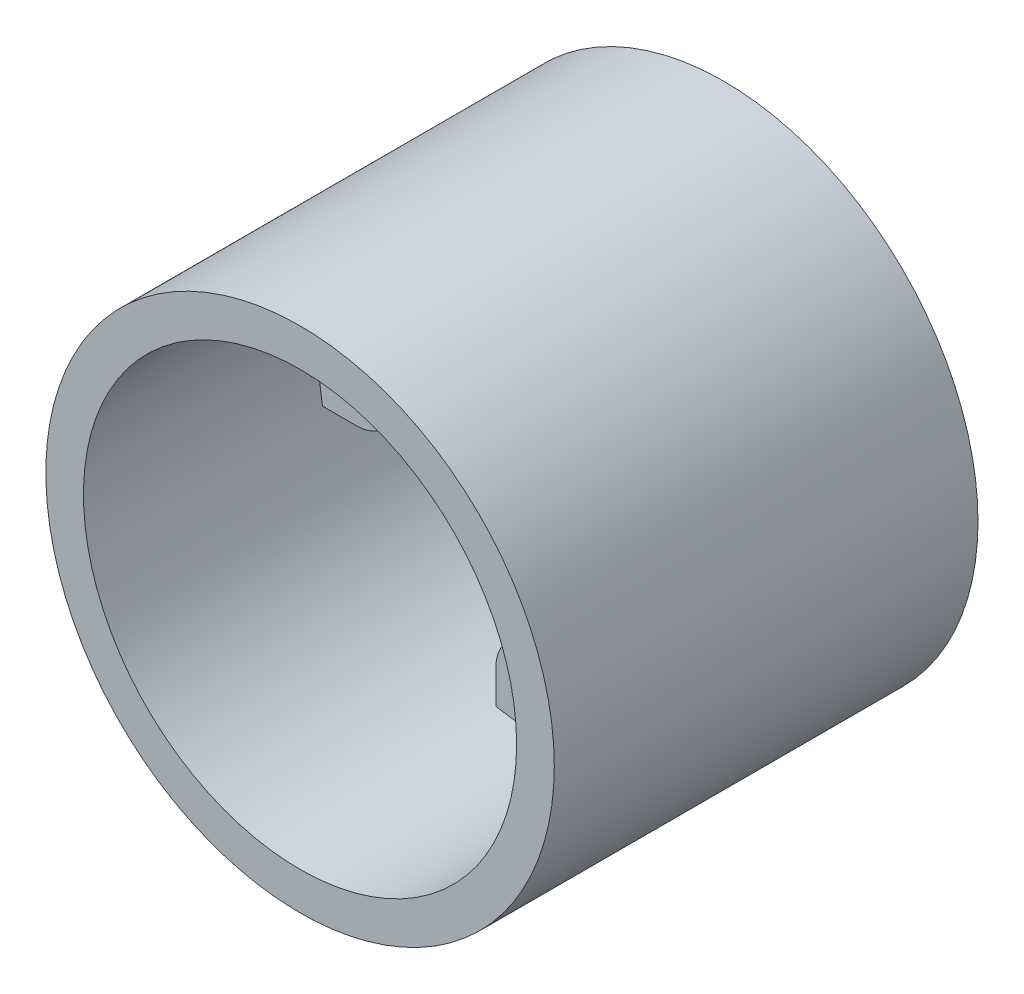
ISO-10303-21;
HEADER;
FILE_DESCRIPTION(('STEP AP214'),'2;1');
FILE_NAME('part.step','',(''),(''),'','','');
FILE_SCHEMA(('AUTOMOTIVE_DESIGN { 1 0 10303 214 1 1 1 1 }'));
ENDSEC;
DATA;
#1=APPLICATION_CONTEXT('core data for automotive mechanical design processes');
#2=APPLICATION_PROTOCOL_DEFINITION('international standard','automotive_design',2000,#1);
#3=PRODUCT_CONTEXT('',#1,'mechanical');
#4=PRODUCT('Part','Part','',(#3));
#5=PRODUCT_RELATED_PRODUCT_CATEGORY('part','',(#4));
#6=PRODUCT_DEFINITION_FORMATION('','',#4);
#7=PRODUCT_DEFINITION_CONTEXT('part definition',#1,'design');
#8=PRODUCT_DEFINITION('design','',#6,#7);
#9=PRODUCT_DEFINITION_SHAPE('','',#8);
#10=(LENGTH_UNIT() NAMED_UNIT(*) SI_UNIT(.MILLI.,.METRE.));
#11=(NAMED_UNIT(*) PLANE_ANGLE_UNIT() SI_UNIT($,.RADIAN.));
#12=(NAMED_UNIT(*) SI_UNIT($,.STERADIAN.) SOLID_ANGLE_UNIT());
#13=UNCERTAINTY_MEASURE_WITH_UNIT(LENGTH_MEASURE(1.E-05),#10,'distance_accuracy_value','');
#14=(GEOMETRIC_REPRESENTATION_CONTEXT(3) GLOBAL_UNCERTAINTY_ASSIGNED_CONTEXT((#13)) GLOBAL_UNIT_ASSIGNED_CONTEXT((#10,
#11,#12)) REPRESENTATION_CONTEXT('',''));
#15=CARTESIAN_POINT('',(0.,0.,0.));
#16=DIRECTION('',(0.,0.,1.));
#17=DIRECTION('',(1.,0.,0.));
#18=AXIS2_PLACEMENT_3D('',#15,#16,#17);
#19=CARTESIAN_POINT('',(0.,0.,45.));
#20=DIRECTION('',(0.,0.,-1.));
#21=DIRECTION('',(-1.,0.,0.));
#22=AXIS2_PLACEMENT_3D('',#19,#20,#21);
#23=CYLINDRICAL_SURFACE('',#22,23.);
#24=DIRECTION('',(0.,0.,-1.));
#25=VECTOR('',#24,1.);
#26=CARTESIAN_POINT('',(22.6132704401641,4.2,20.));
#27=LINE('',#26,#25);
#28=CARTESIAN_POINT('',(22.6132704401641,4.2,20.));
#29=VERTEX_POINT('',#28);
#30=CARTESIAN_POINT('',(22.6132704401641,4.2,0.));
#31=VERTEX_POINT('',#30);
#32=EDGE_CURVE('E206',#29,#31,#27,.T.);
#33=ORIENTED_EDGE('',*,*,#32,.F.);
#34=CARTESIAN_POINT('',(0.,0.,20.));
#35=DIRECTION('',(0.,0.,1.));
#36=DIRECTION('',(1.,0.,0.));
#37=AXIS2_PLACEMENT_3D('',#34,#35,#36);
#38=CIRCLE('',#37,23.);
#39=CARTESIAN_POINT('',(22.6132704401641,-4.2,20.));
#40=VERTEX_POINT('',#39);
#41=EDGE_CURVE('E193',#40,#29,#38,.T.);
#42=ORIENTED_EDGE('',*,*,#41,.F.);
#43=DIRECTION('',(0.,0.,-1.));
#44=VECTOR('',#43,1.);
#45=CARTESIAN_POINT('',(22.6132704401641,-4.2,20.));
#46=LINE('',#45,#44);
#47=CARTESIAN_POINT('',(22.6132704401641,-4.2,0.));
#48=VERTEX_POINT('',#47);
#49=EDGE_CURVE('E221',#40,#48,#46,.T.);
#50=ORIENTED_EDGE('',*,*,#49,.T.);
#51=CARTESIAN_POINT('',(0.,0.,0.));
#52=DIRECTION('',(0.,0.,1.));
#53=DIRECTION('',(1.,0.,0.));
#54=AXIS2_PLACEMENT_3D('',#51,#52,#53);
#55=CIRCLE('',#54,23.);
#56=CARTESIAN_POINT('',(4.2,-22.6132704401641,0.));
#57=VERTEX_POINT('',#56);
#58=EDGE_CURVE('E179',#57,#48,#55,.T.);
#59=ORIENTED_EDGE('',*,*,#58,.F.);
#60=DIRECTION('',(0.,0.,-1.));
#61=VECTOR('',#60,1.);
#62=CARTESIAN_POINT('',(4.2,-22.6132704401641,20.));
#63=LINE('',#62,#61);
#64=CARTESIAN_POINT('',(4.2,-22.6132704401641,20.));
#65=VERTEX_POINT('',#64);
#66=EDGE_CURVE('E246',#65,#57,#63,.T.);
#67=ORIENTED_EDGE('',*,*,#66,.F.);
#68=CARTESIAN_POINT('',(0.,0.,20.));
#69=DIRECTION('',(0.,0.,1.));
#70=DIRECTION('',(1.,0.,0.));
#71=AXIS2_PLACEMENT_3D('',#68,#69,#70);
#72=CIRCLE('',#71,23.);
#73=CARTESIAN_POINT('',(-4.2,-22.6132704401641,20.));
#74=VERTEX_POINT('',#73);
#75=EDGE_CURVE('E243',#74,#65,#72,.T.);
#76=ORIENTED_EDGE('',*,*,#75,.F.);
#77=DIRECTION('',(0.,0.,-1.));
#78=VECTOR('',#77,1.);
#79=CARTESIAN_POINT('',(-4.2,-22.6132704401641,20.));
#80=LINE('',#79,#78);
#81=CARTESIAN_POINT('',(-4.2,-22.6132704401641,0.));
#82=VERTEX_POINT('',#81);
#83=EDGE_CURVE('E262',#74,#82,#80,.T.);
#84=ORIENTED_EDGE('',*,*,#83,.T.);
#85=CARTESIAN_POINT('',(-22.6132704401641,-4.2,0.));
#86=VERTEX_POINT('',#85);
#87=EDGE_CURVE('E374',#86,#82,#55,.T.);
#88=ORIENTED_EDGE('',*,*,#87,.F.);
#89=DIRECTION('',(0.,0.,-1.));
#90=VECTOR('',#89,1.);
#91=CARTESIAN_POINT('',(-22.6132704401641,-4.2,20.));
#92=LINE('',#91,#90);
#93=CARTESIAN_POINT('',(-22.6132704401641,-4.2,20.));
#94=VERTEX_POINT('',#93);
#95=EDGE_CURVE('E291',#94,#86,#92,.T.);
#96=ORIENTED_EDGE('',*,*,#95,.F.);
#97=CARTESIAN_POINT('',(0.,0.,20.));
#98=DIRECTION('',(0.,0.,1.));
#99=DIRECTION('',(1.,0.,0.));
#100=AXIS2_PLACEMENT_3D('',#97,#98,#99);
#101=CIRCLE('',#100,23.);
#102=CARTESIAN_POINT('',(-22.6132704401641,4.2,20.));
#103=VERTEX_POINT('',#102);
#104=EDGE_CURVE('E288',#103,#94,#101,.T.);
#105=ORIENTED_EDGE('',*,*,#104,.F.);
#106=DIRECTION('',(0.,0.,-1.));
#107=VECTOR('',#106,1.);
#108=CARTESIAN_POINT('',(-22.6132704401641,4.2,20.));
#109=LINE('',#108,#107);
#110=CARTESIAN_POINT('',(-22.6132704401641,4.2,0.));
#111=VERTEX_POINT('',#110);
#112=EDGE_CURVE('E307',#103,#111,#109,.T.);
#113=ORIENTED_EDGE('',*,*,#112,.T.);
#114=CARTESIAN_POINT('',(-4.2,22.6132704401641,0.));
#115=VERTEX_POINT('',#114);
#116=EDGE_CURVE('E368',#115,#111,#55,.T.);
#117=ORIENTED_EDGE('',*,*,#116,.F.);
#118=DIRECTION('',(0.,0.,-1.));
#119=VECTOR('',#118,1.);
#120=CARTESIAN_POINT('',(-4.2,22.6132704401641,20.));
#121=LINE('',#120,#119);
#122=CARTESIAN_POINT('',(-4.2,22.6132704401641,20.));
#123=VERTEX_POINT('',#122);
#124=EDGE_CURVE('E336',#123,#115,#121,.T.);
#125=ORIENTED_EDGE('',*,*,#124,.F.);
#126=CARTESIAN_POINT('',(0.,0.,20.));
#127=DIRECTION('',(0.,0.,1.));
#128=DIRECTION('',(1.,0.,0.));
#129=AXIS2_PLACEMENT_3D('',#126,#127,#128);
#130=CIRCLE('',#129,23.);
#131=CARTESIAN_POINT('',(4.2,22.6132704401641,20.));
#132=VERTEX_POINT('',#131);
#133=EDGE_CURVE('E333',#132,#123,#130,.T.);
#134=ORIENTED_EDGE('',*,*,#133,.F.);
#135=DIRECTION('',(0.,0.,-1.));
#136=VECTOR('',#135,1.);
#137=CARTESIAN_POINT('',(4.2,22.6132704401641,20.));
#138=LINE('',#137,#136);
#139=CARTESIAN_POINT('',(4.2,22.6132704401641,0.));
#140=VERTEX_POINT('',#139);
#141=EDGE_CURVE('E353',#132,#140,#138,.T.);
#142=ORIENTED_EDGE('',*,*,#141,.T.);
#143=EDGE_CURVE('E365',#31,#140,#55,.T.);
#144=ORIENTED_EDGE('',*,*,#143,.F.);
#145=EDGE_LOOP('',(#33,#42,#50,#59,#67,#76,#84,#88,#96,#105,#113,#117,#125,#134,#142,#144));
#146=FACE_BOUND('',#145,.T.);
#147=CARTESIAN_POINT('',(0.,0.,45.));
#148=DIRECTION('',(0.,0.,1.));
#149=DIRECTION('',(1.,0.,0.));
#150=AXIS2_PLACEMENT_3D('',#147,#148,#149);
#151=CIRCLE('',#150,23.);
#152=CARTESIAN_POINT('',(23.,0.,45.));
#153=VERTEX_POINT('',#152);
#154=EDGE_CURVE('E58',#153,#153,#151,.T.);
#155=ORIENTED_EDGE('',*,*,#154,.T.);
#156=EDGE_LOOP('',(#155));
#157=FACE_BOUND('',#156,.T.);
#158=ADVANCED_FACE('F49',(#146,#157),#23,.F.);
#159=CARTESIAN_POINT('',(0.,0.,45.));
#160=DIRECTION('',(0.,0.,-1.));
#161=DIRECTION('',(-1.,0.,0.));
#162=AXIS2_PLACEMENT_3D('',#159,#160,#161);
#163=CYLINDRICAL_SURFACE('',#162,27.);
#164=CARTESIAN_POINT('',(0.,0.,45.));
#165=DIRECTION('',(0.,0.,1.));
#166=DIRECTION('',(1.,0.,0.));
#167=AXIS2_PLACEMENT_3D('',#164,#165,#166);
#168=CIRCLE('',#167,27.);
#169=CARTESIAN_POINT('',(27.,0.,45.));
#170=VERTEX_POINT('',#169);
#171=EDGE_CURVE('E11',#170,#170,#168,.T.);
#172=ORIENTED_EDGE('',*,*,#171,.F.);
#173=EDGE_LOOP('',(#172));
#174=FACE_BOUND('',#173,.T.);
#175=CARTESIAN_POINT('',(0.,0.,0.));
#176=DIRECTION('',(0.,0.,1.));
#177=DIRECTION('',(1.,0.,0.));
#178=AXIS2_PLACEMENT_3D('',#175,#176,#177);
#179=CIRCLE('',#178,27.);
#180=CARTESIAN_POINT('',(27.,0.,0.));
#181=VERTEX_POINT('',#180);
#182=EDGE_CURVE('E52',#181,#181,#179,.T.);
#183=ORIENTED_EDGE('',*,*,#182,.T.);
#184=EDGE_LOOP('',(#183));
#185=FACE_BOUND('',#184,.T.);
#186=ADVANCED_FACE('F441',(#174,#185),#163,.T.);
#187=CARTESIAN_POINT('',(0.,0.,45.));
#188=DIRECTION('',(0.,0.,1.));
#189=DIRECTION('',(1.,0.,0.));
#190=AXIS2_PLACEMENT_3D('',#187,#188,#189);
#191=PLANE('',#190);
#192=ORIENTED_EDGE('',*,*,#154,.F.);
#193=EDGE_LOOP('',(#192));
#194=FACE_BOUND('',#193,.T.);
#195=ORIENTED_EDGE('',*,*,#171,.T.);
#196=EDGE_LOOP('',(#195));
#197=FACE_BOUND('',#196,.T.);
#198=ADVANCED_FACE('F447',(#194,#197),#191,.T.);
#199=CARTESIAN_POINT('',(0.,0.,0.));
#200=DIRECTION('',(0.,0.,1.));
#201=DIRECTION('',(1.,0.,0.));
#202=AXIS2_PLACEMENT_3D('',#199,#200,#201);
#203=PLANE('',#202);
#204=ORIENTED_EDGE('',*,*,#143,.T.);
#205=DIRECTION('',(0.,1.,0.));
#206=VECTOR('',#205,1.);
#207=CARTESIAN_POINT('',(4.2,0.,0.));
#208=LINE('',#207,#206);
#209=CARTESIAN_POINT('',(4.2,19.,0.));
#210=VERTEX_POINT('',#209);
#211=EDGE_CURVE('E322',#210,#140,#208,.T.);
#212=ORIENTED_EDGE('',*,*,#211,.F.);
#213=CARTESIAN_POINT('',(0.,19.,0.));
#214=DIRECTION('',(0.,0.,1.));
#215=DIRECTION('',(1.,0.,0.));
#216=AXIS2_PLACEMENT_3D('',#213,#214,#215);
#217=CIRCLE('',#216,4.2);
#218=CARTESIAN_POINT('',(-4.2,19.,0.));
#219=VERTEX_POINT('',#218);
#220=EDGE_CURVE('E344',#219,#210,#217,.T.);
#221=ORIENTED_EDGE('',*,*,#220,.F.);
#222=DIRECTION('',(0.,1.,0.));
#223=VECTOR('',#222,1.);
#224=CARTESIAN_POINT('',(-4.2,0.,0.));
#225=LINE('',#224,#223);
#226=EDGE_CURVE('E341',#219,#115,#225,.T.);
#227=ORIENTED_EDGE('',*,*,#226,.T.);
#228=ORIENTED_EDGE('',*,*,#116,.T.);
#229=DIRECTION('',(-1.,0.,0.));
#230=VECTOR('',#229,1.);
#231=CARTESIAN_POINT('',(0.,4.19999999999998,0.));
#232=LINE('',#231,#230);
#233=CARTESIAN_POINT('',(-19.,4.2,0.));
#234=VERTEX_POINT('',#233);
#235=EDGE_CURVE('E277',#234,#111,#232,.T.);
#236=ORIENTED_EDGE('',*,*,#235,.F.);
#237=CARTESIAN_POINT('',(-19.,0.,0.));
#238=DIRECTION('',(0.,0.,1.));
#239=DIRECTION('',(1.,0.,0.));
#240=AXIS2_PLACEMENT_3D('',#237,#238,#239);
#241=CIRCLE('',#240,4.2);
#242=CARTESIAN_POINT('',(-19.,-4.2,0.));
#243=VERTEX_POINT('',#242);
#244=EDGE_CURVE('E299',#243,#234,#241,.T.);
#245=ORIENTED_EDGE('',*,*,#244,.F.);
#246=DIRECTION('',(-1.,0.,0.));
#247=VECTOR('',#246,1.);
#248=CARTESIAN_POINT('',(0.,-4.20000000000002,0.));
#249=LINE('',#248,#247);
#250=EDGE_CURVE('E73',#243,#86,#249,.T.);
#251=ORIENTED_EDGE('',*,*,#250,.T.);
#252=ORIENTED_EDGE('',*,*,#87,.T.);
#253=DIRECTION('',(0.,-1.,0.));
#254=VECTOR('',#253,1.);
#255=CARTESIAN_POINT('',(-4.2,0.,0.));
#256=LINE('',#255,#254);
#257=CARTESIAN_POINT('',(-4.2,-19.,0.));
#258=VERTEX_POINT('',#257);
#259=EDGE_CURVE('E232',#258,#82,#256,.T.);
#260=ORIENTED_EDGE('',*,*,#259,.F.);
#261=CARTESIAN_POINT('',(0.,-19.,0.));
#262=DIRECTION('',(0.,0.,1.));
#263=DIRECTION('',(1.,0.,0.));
#264=AXIS2_PLACEMENT_3D('',#261,#262,#263);
#265=CIRCLE('',#264,4.2);
#266=CARTESIAN_POINT('',(4.2,-19.,0.));
#267=VERTEX_POINT('',#266);
#268=EDGE_CURVE('E254',#267,#258,#265,.T.);
#269=ORIENTED_EDGE('',*,*,#268,.F.);
#270=DIRECTION('',(0.,-1.,0.));
#271=VECTOR('',#270,1.);
#272=CARTESIAN_POINT('',(4.2,0.,0.));
#273=LINE('',#272,#271);
#274=EDGE_CURVE('E66',#267,#57,#273,.T.);
#275=ORIENTED_EDGE('',*,*,#274,.T.);
#276=ORIENTED_EDGE('',*,*,#58,.T.);
#277=DIRECTION('',(1.,0.,0.));
#278=VECTOR('',#277,1.);
#279=CARTESIAN_POINT('',(0.,-4.2,0.));
#280=LINE('',#279,#278);
#281=CARTESIAN_POINT('',(19.,-4.2,0.));
#282=VERTEX_POINT('',#281);
#283=EDGE_CURVE('E199',#282,#48,#280,.T.);
#284=ORIENTED_EDGE('',*,*,#283,.F.);
#285=CARTESIAN_POINT('',(19.,0.,0.));
#286=DIRECTION('',(0.,0.,1.));
#287=DIRECTION('',(1.,0.,0.));
#288=AXIS2_PLACEMENT_3D('',#285,#286,#287);
#289=CIRCLE('',#288,4.2);
#290=CARTESIAN_POINT('',(19.,4.2,0.));
#291=VERTEX_POINT('',#290);
#292=EDGE_CURVE('E214',#291,#282,#289,.T.);
#293=ORIENTED_EDGE('',*,*,#292,.F.);
#294=DIRECTION('',(1.,0.,0.));
#295=VECTOR('',#294,1.);
#296=CARTESIAN_POINT('',(0.,4.19999999999999,0.));
#297=LINE('',#296,#295);
#298=EDGE_CURVE('E174',#291,#31,#297,.T.);
#299=ORIENTED_EDGE('',*,*,#298,.T.);
#300=EDGE_LOOP('',(#204,#212,#221,#227,#228,#236,#245,#251,#252,#260,#269,#275,#276,#284,#293,#299));
#301=FACE_BOUND('',#300,.T.);
#302=ORIENTED_EDGE('',*,*,#182,.F.);
#303=EDGE_LOOP('',(#302));
#304=FACE_BOUND('',#303,.T.);
#305=CARTESIAN_POINT('',(0.,19.,0.));
#306=DIRECTION('',(0.,0.,1.));
#307=DIRECTION('',(1.,0.,0.));
#308=AXIS2_PLACEMENT_3D('',#305,#306,#307);
#309=CIRCLE('',#308,1.7);
#310=CARTESIAN_POINT('',(1.7,19.,0.));
#311=VERTEX_POINT('',#310);
#312=EDGE_CURVE('E337',#311,#311,#309,.T.);
#313=ORIENTED_EDGE('',*,*,#312,.T.);
#314=EDGE_LOOP('',(#313));
#315=FACE_BOUND('',#314,.T.);
#316=CARTESIAN_POINT('',(-19.,0.,0.));
#317=DIRECTION('',(0.,0.,1.));
#318=DIRECTION('',(1.,0.,0.));
#319=AXIS2_PLACEMENT_3D('',#316,#317,#318);
#320=CIRCLE('',#319,1.7);
#321=CARTESIAN_POINT('',(-17.3,0.,0.));
#322=VERTEX_POINT('',#321);
#323=EDGE_CURVE('E292',#322,#322,#320,.T.);
#324=ORIENTED_EDGE('',*,*,#323,.T.);
#325=EDGE_LOOP('',(#324));
#326=FACE_BOUND('',#325,.T.);
#327=CARTESIAN_POINT('',(0.,-19.,0.));
#328=DIRECTION('',(0.,0.,1.));
#329=DIRECTION('',(1.,0.,0.));
#330=AXIS2_PLACEMENT_3D('',#327,#328,#329);
#331=CIRCLE('',#330,1.7);
#332=CARTESIAN_POINT('',(1.7,-19.,0.));
#333=VERTEX_POINT('',#332);
#334=EDGE_CURVE('E247',#333,#333,#331,.T.);
#335=ORIENTED_EDGE('',*,*,#334,.T.);
#336=EDGE_LOOP('',(#335));
#337=FACE_BOUND('',#336,.T.);
#338=CARTESIAN_POINT('',(19.,0.,0.));
#339=DIRECTION('',(0.,0.,1.));
#340=DIRECTION('',(1.,0.,0.));
#341=AXIS2_PLACEMENT_3D('',#338,#339,#340);
#342=CIRCLE('',#341,1.7);
#343=CARTESIAN_POINT('',(20.7,0.,0.));
#344=VERTEX_POINT('',#343);
#345=EDGE_CURVE('E207',#344,#344,#342,.T.);
#346=ORIENTED_EDGE('',*,*,#345,.T.);
#347=EDGE_LOOP('',(#346));
#348=FACE_BOUND('',#347,.T.);
#349=ADVANCED_FACE('F379',(#301,#304,#315,#326,#337,#348),#203,.F.);
#350=CARTESIAN_POINT('',(-4.2,0.,20.));
#351=DIRECTION('',(-1.,0.,0.));
#352=DIRECTION('',(0.,-1.,0.));
#353=AXIS2_PLACEMENT_3D('',#350,#351,#352);
#354=PLANE('',#353);
#355=ORIENTED_EDGE('',*,*,#226,.F.);
#356=DIRECTION('',(0.,0.,-1.));
#357=VECTOR('',#356,1.);
#358=CARTESIAN_POINT('',(-4.2,19.,20.));
#359=LINE('',#358,#357);
#360=CARTESIAN_POINT('',(-4.2,19.,20.));
#361=VERTEX_POINT('',#360);
#362=EDGE_CURVE('E296',#361,#219,#359,.T.);
#363=ORIENTED_EDGE('',*,*,#362,.F.);
#364=DIRECTION('',(0.,1.,0.));
#365=VECTOR('',#364,1.);
#366=CARTESIAN_POINT('',(-4.2,0.,20.));
#367=LINE('',#366,#365);
#368=EDGE_CURVE('E321',#361,#123,#367,.T.);
#369=ORIENTED_EDGE('',*,*,#368,.T.);
#370=ORIENTED_EDGE('',*,*,#124,.T.);
#371=EDGE_LOOP('',(#355,#363,#369,#370));
#372=FACE_BOUND('',#371,.T.);
#373=ADVANCED_FACE('F410',(#372),#354,.T.);
#374=CARTESIAN_POINT('',(0.,19.,20.));
#375=DIRECTION('',(0.,0.,-1.));
#376=DIRECTION('',(-1.,0.,0.));
#377=AXIS2_PLACEMENT_3D('',#374,#375,#376);
#378=CYLINDRICAL_SURFACE('',#377,4.2);
#379=ORIENTED_EDGE('',*,*,#220,.T.);
#380=DIRECTION('',(0.,0.,-1.));
#381=VECTOR('',#380,1.);
#382=CARTESIAN_POINT('',(4.2,19.,20.));
#383=LINE('',#382,#381);
#384=CARTESIAN_POINT('',(4.2,19.,20.));
#385=VERTEX_POINT('',#384);
#386=EDGE_CURVE('E357',#385,#210,#383,.T.);
#387=ORIENTED_EDGE('',*,*,#386,.F.);
#388=CARTESIAN_POINT('',(0.,19.,20.));
#389=DIRECTION('',(0.,0.,1.));
#390=DIRECTION('',(1.,0.,0.));
#391=AXIS2_PLACEMENT_3D('',#388,#389,#390);
#392=CIRCLE('',#391,4.2);
#393=EDGE_CURVE('E326',#361,#385,#392,.T.);
#394=ORIENTED_EDGE('',*,*,#393,.F.);
#395=ORIENTED_EDGE('',*,*,#362,.T.);
#396=EDGE_LOOP('',(#379,#387,#394,#395));
#397=FACE_BOUND('',#396,.T.);
#398=ADVANCED_FACE('F464',(#397),#378,.T.);
#399=CARTESIAN_POINT('',(4.2,0.,20.));
#400=DIRECTION('',(-1.,0.,0.));
#401=DIRECTION('',(0.,-1.,0.));
#402=AXIS2_PLACEMENT_3D('',#399,#400,#401);
#403=PLANE('',#402);
#404=ORIENTED_EDGE('',*,*,#211,.T.);
#405=ORIENTED_EDGE('',*,*,#141,.F.);
#406=DIRECTION('',(0.,1.,0.));
#407=VECTOR('',#406,1.);
#408=CARTESIAN_POINT('',(4.2,0.,20.));
#409=LINE('',#408,#407);
#410=EDGE_CURVE('E330',#385,#132,#409,.T.);
#411=ORIENTED_EDGE('',*,*,#410,.F.);
#412=ORIENTED_EDGE('',*,*,#386,.T.);
#413=EDGE_LOOP('',(#404,#405,#411,#412));
#414=FACE_BOUND('',#413,.T.);
#415=ADVANCED_FACE('F404',(#414),#403,.F.);
#416=CARTESIAN_POINT('',(0.,19.,20.));
#417=DIRECTION('',(0.,0.,-1.));
#418=DIRECTION('',(-1.,0.,0.));
#419=AXIS2_PLACEMENT_3D('',#416,#417,#418);
#420=CYLINDRICAL_SURFACE('',#419,1.7);
#421=CARTESIAN_POINT('',(0.,19.,20.));
#422=DIRECTION('',(0.,0.,1.));
#423=DIRECTION('',(1.,0.,0.));
#424=AXIS2_PLACEMENT_3D('',#421,#422,#423);
#425=CIRCLE('',#424,1.7);
#426=CARTESIAN_POINT('',(1.7,19.,20.));
#427=VERTEX_POINT('',#426);
#428=EDGE_CURVE('E317',#427,#427,#425,.T.);
#429=ORIENTED_EDGE('',*,*,#428,.T.);
#430=EDGE_LOOP('',(#429));
#431=FACE_BOUND('',#430,.T.);
#432=ORIENTED_EDGE('',*,*,#312,.F.);
#433=EDGE_LOOP('',(#432));
#434=FACE_BOUND('',#433,.T.);
#435=ADVANCED_FACE('F457',(#431,#434),#420,.F.);
#436=CARTESIAN_POINT('',(0.,0.,20.));
#437=DIRECTION('',(0.,0.,1.));
#438=DIRECTION('',(1.,0.,0.));
#439=AXIS2_PLACEMENT_3D('',#436,#437,#438);
#440=PLANE('',#439);
#441=ORIENTED_EDGE('',*,*,#428,.F.);
#442=EDGE_LOOP('',(#441));
#443=FACE_BOUND('',#442,.T.);
#444=ORIENTED_EDGE('',*,*,#368,.F.);
#445=ORIENTED_EDGE('',*,*,#393,.T.);
#446=ORIENTED_EDGE('',*,*,#410,.T.);
#447=ORIENTED_EDGE('',*,*,#133,.T.);
#448=EDGE_LOOP('',(#444,#445,#446,#447));
#449=FACE_BOUND('',#448,.T.);
#450=ADVANCED_FACE('F460',(#443,#449),#440,.T.);
#451=CARTESIAN_POINT('',(0.,-4.20000000000002,20.));
#452=DIRECTION('',(0.,-1.,0.));
#453=DIRECTION('',(1.,0.,0.));
#454=AXIS2_PLACEMENT_3D('',#451,#452,#453);
#455=PLANE('',#454);
#456=ORIENTED_EDGE('',*,*,#250,.F.);
#457=DIRECTION('',(0.,0.,-1.));
#458=VECTOR('',#457,1.);
#459=CARTESIAN_POINT('',(-19.,-4.2,20.));
#460=LINE('',#459,#458);
#461=CARTESIAN_POINT('',(-19.,-4.2,20.));
#462=VERTEX_POINT('',#461);
#463=EDGE_CURVE('E251',#462,#243,#460,.T.);
#464=ORIENTED_EDGE('',*,*,#463,.F.);
#465=DIRECTION('',(-1.,0.,0.));
#466=VECTOR('',#465,1.);
#467=CARTESIAN_POINT('',(0.,-4.20000000000002,20.));
#468=LINE('',#467,#466);
#469=EDGE_CURVE('E276',#462,#94,#468,.T.);
#470=ORIENTED_EDGE('',*,*,#469,.T.);
#471=ORIENTED_EDGE('',*,*,#95,.T.);
#472=EDGE_LOOP('',(#456,#464,#470,#471));
#473=FACE_BOUND('',#472,.T.);
#474=ADVANCED_FACE('F423',(#473),#455,.T.);
#475=CARTESIAN_POINT('',(-19.,0.,20.));
#476=DIRECTION('',(0.,0.,-1.));
#477=DIRECTION('',(-1.,0.,0.));
#478=AXIS2_PLACEMENT_3D('',#475,#476,#477);
#479=CYLINDRICAL_SURFACE('',#478,4.2);
#480=ORIENTED_EDGE('',*,*,#244,.T.);
#481=DIRECTION('',(0.,0.,-1.));
#482=VECTOR('',#481,1.);
#483=CARTESIAN_POINT('',(-19.,4.2,20.));
#484=LINE('',#483,#482);
#485=CARTESIAN_POINT('',(-19.,4.2,20.));
#486=VERTEX_POINT('',#485);
#487=EDGE_CURVE('E311',#486,#234,#484,.T.);
#488=ORIENTED_EDGE('',*,*,#487,.F.);
#489=CARTESIAN_POINT('',(-19.,0.,20.));
#490=DIRECTION('',(0.,0.,1.));
#491=DIRECTION('',(1.,0.,0.));
#492=AXIS2_PLACEMENT_3D('',#489,#490,#491);
#493=CIRCLE('',#492,4.2);
#494=EDGE_CURVE('E281',#462,#486,#493,.T.);
#495=ORIENTED_EDGE('',*,*,#494,.F.);
#496=ORIENTED_EDGE('',*,*,#463,.T.);
#497=EDGE_LOOP('',(#480,#488,#495,#496));
#498=FACE_BOUND('',#497,.T.);
#499=ADVANCED_FACE('F420',(#498),#479,.T.);
#500=CARTESIAN_POINT('',(0.,4.19999999999998,20.));
#501=DIRECTION('',(0.,-1.,0.));
#502=DIRECTION('',(1.,0.,0.));
#503=AXIS2_PLACEMENT_3D('',#500,#501,#502);
#504=PLANE('',#503);
#505=ORIENTED_EDGE('',*,*,#235,.T.);
#506=ORIENTED_EDGE('',*,*,#112,.F.);
#507=DIRECTION('',(-1.,0.,0.));
#508=VECTOR('',#507,1.);
#509=CARTESIAN_POINT('',(0.,4.19999999999998,20.));
#510=LINE('',#509,#508);
#511=EDGE_CURVE('E285',#486,#103,#510,.T.);
#512=ORIENTED_EDGE('',*,*,#511,.F.);
#513=ORIENTED_EDGE('',*,*,#487,.T.);
#514=EDGE_LOOP('',(#505,#506,#512,#513));
#515=FACE_BOUND('',#514,.T.);
#516=ADVANCED_FACE('F417',(#515),#504,.F.);
#517=CARTESIAN_POINT('',(-19.,0.,20.));
#518=DIRECTION('',(0.,0.,-1.));
#519=DIRECTION('',(-1.,0.,0.));
#520=AXIS2_PLACEMENT_3D('',#517,#518,#519);
#521=CYLINDRICAL_SURFACE('',#520,1.7);
#522=CARTESIAN_POINT('',(-19.,0.,20.));
#523=DIRECTION('',(0.,0.,1.));
#524=DIRECTION('',(1.,0.,0.));
#525=AXIS2_PLACEMENT_3D('',#522,#523,#524);
#526=CIRCLE('',#525,1.7);
#527=CARTESIAN_POINT('',(-17.3,0.,20.));
#528=VERTEX_POINT('',#527);
#529=EDGE_CURVE('E272',#528,#528,#526,.T.);
#530=ORIENTED_EDGE('',*,*,#529,.T.);
#531=EDGE_LOOP('',(#530));
#532=FACE_BOUND('',#531,.T.);
#533=ORIENTED_EDGE('',*,*,#323,.F.);
#534=EDGE_LOOP('',(#533));
#535=FACE_BOUND('',#534,.T.);
#536=ADVANCED_FACE('F427',(#532,#535),#521,.F.);
#537=CARTESIAN_POINT('',(0.,0.,20.));
#538=DIRECTION('',(0.,0.,1.));
#539=DIRECTION('',(1.,0.,0.));
#540=AXIS2_PLACEMENT_3D('',#537,#538,#539);
#541=PLANE('',#540);
#542=ORIENTED_EDGE('',*,*,#529,.F.);
#543=EDGE_LOOP('',(#542));
#544=FACE_BOUND('',#543,.T.);
#545=ORIENTED_EDGE('',*,*,#469,.F.);
#546=ORIENTED_EDGE('',*,*,#494,.T.);
#547=ORIENTED_EDGE('',*,*,#511,.T.);
#548=ORIENTED_EDGE('',*,*,#104,.T.);
#549=EDGE_LOOP('',(#545,#546,#547,#548));
#550=FACE_BOUND('',#549,.T.);
#551=ADVANCED_FACE('F425',(#544,#550),#541,.T.);
#552=CARTESIAN_POINT('',(4.2,0.,20.));
#553=DIRECTION('',(1.,0.,0.));
#554=DIRECTION('',(0.,1.,0.));
#555=AXIS2_PLACEMENT_3D('',#552,#553,#554);
#556=PLANE('',#555);
#557=ORIENTED_EDGE('',*,*,#274,.F.);
#558=DIRECTION('',(0.,0.,-1.));
#559=VECTOR('',#558,1.);
#560=CARTESIAN_POINT('',(4.2,-19.,20.));
#561=LINE('',#560,#559);
#562=CARTESIAN_POINT('',(4.2,-19.,20.));
#563=VERTEX_POINT('',#562);
#564=EDGE_CURVE('E211',#563,#267,#561,.T.);
#565=ORIENTED_EDGE('',*,*,#564,.F.);
#566=DIRECTION('',(0.,-1.,0.));
#567=VECTOR('',#566,1.);
#568=CARTESIAN_POINT('',(4.2,0.,20.));
#569=LINE('',#568,#567);
#570=EDGE_CURVE('E231',#563,#65,#569,.T.);
#571=ORIENTED_EDGE('',*,*,#570,.T.);
#572=ORIENTED_EDGE('',*,*,#66,.T.);
#573=EDGE_LOOP('',(#557,#565,#571,#572));
#574=FACE_BOUND('',#573,.T.);
#575=ADVANCED_FACE('F395',(#574),#556,.T.);
#576=CARTESIAN_POINT('',(0.,-19.,20.));
#577=DIRECTION('',(0.,0.,-1.));
#578=DIRECTION('',(-1.,0.,0.));
#579=AXIS2_PLACEMENT_3D('',#576,#577,#578);
#580=CYLINDRICAL_SURFACE('',#579,4.2);
#581=ORIENTED_EDGE('',*,*,#268,.T.);
#582=DIRECTION('',(0.,0.,-1.));
#583=VECTOR('',#582,1.);
#584=CARTESIAN_POINT('',(-4.2,-19.,20.));
#585=LINE('',#584,#583);
#586=CARTESIAN_POINT('',(-4.2,-19.,20.));
#587=VERTEX_POINT('',#586);
#588=EDGE_CURVE('E266',#587,#258,#585,.T.);
#589=ORIENTED_EDGE('',*,*,#588,.F.);
#590=CARTESIAN_POINT('',(0.,-19.,20.));
#591=DIRECTION('',(0.,0.,1.));
#592=DIRECTION('',(1.,0.,0.));
#593=AXIS2_PLACEMENT_3D('',#590,#591,#592);
#594=CIRCLE('',#593,4.2);
#595=EDGE_CURVE('E236',#563,#587,#594,.T.);
#596=ORIENTED_EDGE('',*,*,#595,.F.);
#597=ORIENTED_EDGE('',*,*,#564,.T.);
#598=EDGE_LOOP('',(#581,#589,#596,#597));
#599=FACE_BOUND('',#598,.T.);
#600=ADVANCED_FACE('F393',(#599),#580,.T.);
#601=CARTESIAN_POINT('',(-4.2,0.,20.));
#602=DIRECTION('',(1.,0.,0.));
#603=DIRECTION('',(0.,0.,-1.));
#604=AXIS2_PLACEMENT_3D('',#601,#602,#603);
#605=PLANE('',#604);
#606=ORIENTED_EDGE('',*,*,#259,.T.);
#607=ORIENTED_EDGE('',*,*,#83,.F.);
#608=DIRECTION('',(0.,-1.,0.));
#609=VECTOR('',#608,1.);
#610=CARTESIAN_POINT('',(-4.2,0.,20.));
#611=LINE('',#610,#609);
#612=EDGE_CURVE('E240',#587,#74,#611,.T.);
#613=ORIENTED_EDGE('',*,*,#612,.F.);
#614=ORIENTED_EDGE('',*,*,#588,.T.);
#615=EDGE_LOOP('',(#606,#607,#613,#614));
#616=FACE_BOUND('',#615,.T.);
#617=ADVANCED_FACE('F389',(#616),#605,.F.);
#618=CARTESIAN_POINT('',(0.,-19.,20.));
#619=DIRECTION('',(0.,0.,-1.));
#620=DIRECTION('',(-1.,0.,0.));
#621=AXIS2_PLACEMENT_3D('',#618,#619,#620);
#622=CYLINDRICAL_SURFACE('',#621,1.7);
#623=CARTESIAN_POINT('',(0.,-19.,20.));
#624=DIRECTION('',(0.,0.,1.));
#625=DIRECTION('',(1.,0.,0.));
#626=AXIS2_PLACEMENT_3D('',#623,#624,#625);
#627=CIRCLE('',#626,1.7);
#628=CARTESIAN_POINT('',(1.7,-19.,20.));
#629=VERTEX_POINT('',#628);
#630=EDGE_CURVE('E227',#629,#629,#627,.T.);
#631=ORIENTED_EDGE('',*,*,#630,.T.);
#632=EDGE_LOOP('',(#631));
#633=FACE_BOUND('',#632,.T.);
#634=ORIENTED_EDGE('',*,*,#334,.F.);
#635=EDGE_LOOP('',(#634));
#636=FACE_BOUND('',#635,.T.);
#637=ADVANCED_FACE('F513',(#633,#636),#622,.F.);
#638=CARTESIAN_POINT('',(0.,0.,20.));
#639=DIRECTION('',(0.,0.,1.));
#640=DIRECTION('',(1.,0.,0.));
#641=AXIS2_PLACEMENT_3D('',#638,#639,#640);
#642=PLANE('',#641);
#643=ORIENTED_EDGE('',*,*,#630,.F.);
#644=EDGE_LOOP('',(#643));
#645=FACE_BOUND('',#644,.T.);
#646=ORIENTED_EDGE('',*,*,#570,.F.);
#647=ORIENTED_EDGE('',*,*,#595,.T.);
#648=ORIENTED_EDGE('',*,*,#612,.T.);
#649=ORIENTED_EDGE('',*,*,#75,.T.);
#650=EDGE_LOOP('',(#646,#647,#648,#649));
#651=FACE_BOUND('',#650,.T.);
#652=ADVANCED_FACE('F522',(#645,#651),#642,.T.);
#653=CARTESIAN_POINT('',(0.,4.19999999999999,20.));
#654=DIRECTION('',(0.,1.,0.));
#655=DIRECTION('',(-1.,0.,0.));
#656=AXIS2_PLACEMENT_3D('',#653,#654,#655);
#657=PLANE('',#656);
#658=ORIENTED_EDGE('',*,*,#298,.F.);
#659=DIRECTION('',(0.,0.,-1.));
#660=VECTOR('',#659,1.);
#661=CARTESIAN_POINT('',(19.,4.2,20.));
#662=LINE('',#661,#660);
#663=CARTESIAN_POINT('',(19.,4.2,20.));
#664=VERTEX_POINT('',#663);
#665=EDGE_CURVE('E167',#664,#291,#662,.T.);
#666=ORIENTED_EDGE('',*,*,#665,.F.);
#667=DIRECTION('',(1.,0.,0.));
#668=VECTOR('',#667,1.);
#669=CARTESIAN_POINT('',(0.,4.19999999999999,20.));
#670=LINE('',#669,#668);
#671=EDGE_CURVE('E172',#664,#29,#670,.T.);
#672=ORIENTED_EDGE('',*,*,#671,.T.);
#673=ORIENTED_EDGE('',*,*,#32,.T.);
#674=EDGE_LOOP('',(#658,#666,#672,#673));
#675=FACE_BOUND('',#674,.T.);
#676=ADVANCED_FACE('F169',(#675),#657,.T.);
#677=CARTESIAN_POINT('',(19.,0.,20.));
#678=DIRECTION('',(0.,0.,-1.));
#679=DIRECTION('',(-1.,0.,0.));
#680=AXIS2_PLACEMENT_3D('',#677,#678,#679);
#681=CYLINDRICAL_SURFACE('',#680,4.2);
#682=ORIENTED_EDGE('',*,*,#292,.T.);
#683=DIRECTION('',(0.,0.,-1.));
#684=VECTOR('',#683,1.);
#685=CARTESIAN_POINT('',(19.,-4.2,20.));
#686=LINE('',#685,#684);
#687=CARTESIAN_POINT('',(19.,-4.2,20.));
#688=VERTEX_POINT('',#687);
#689=EDGE_CURVE('E180',#688,#282,#686,.T.);
#690=ORIENTED_EDGE('',*,*,#689,.F.);
#691=CARTESIAN_POINT('',(19.,0.,20.));
#692=DIRECTION('',(0.,0.,1.));
#693=DIRECTION('',(1.,0.,0.));
#694=AXIS2_PLACEMENT_3D('',#691,#692,#693);
#695=CIRCLE('',#694,4.2);
#696=EDGE_CURVE('E184',#664,#688,#695,.T.);
#697=ORIENTED_EDGE('',*,*,#696,.F.);
#698=ORIENTED_EDGE('',*,*,#665,.T.);
#699=EDGE_LOOP('',(#682,#690,#697,#698));
#700=FACE_BOUND('',#699,.T.);
#701=ADVANCED_FACE('F185',(#700),#681,.T.);
#702=CARTESIAN_POINT('',(0.,-4.2,20.));
#703=DIRECTION('',(0.,1.,0.));
#704=DIRECTION('',(0.,0.,1.));
#705=AXIS2_PLACEMENT_3D('',#702,#703,#704);
#706=PLANE('',#705);
#707=ORIENTED_EDGE('',*,*,#283,.T.);
#708=ORIENTED_EDGE('',*,*,#49,.F.);
#709=DIRECTION('',(1.,0.,0.));
#710=VECTOR('',#709,1.);
#711=CARTESIAN_POINT('',(0.,-4.2,20.));
#712=LINE('',#711,#710);
#713=EDGE_CURVE('E189',#688,#40,#712,.T.);
#714=ORIENTED_EDGE('',*,*,#713,.F.);
#715=ORIENTED_EDGE('',*,*,#689,.T.);
#716=EDGE_LOOP('',(#707,#708,#714,#715));
#717=FACE_BOUND('',#716,.T.);
#718=ADVANCED_FACE('F399',(#717),#706,.F.);
#719=CARTESIAN_POINT('',(19.,0.,20.));
#720=DIRECTION('',(0.,0.,-1.));
#721=DIRECTION('',(-1.,0.,0.));
#722=AXIS2_PLACEMENT_3D('',#719,#720,#721);
#723=CYLINDRICAL_SURFACE('',#722,1.7);
#724=CARTESIAN_POINT('',(19.,0.,20.));
#725=DIRECTION('',(0.,0.,1.));
#726=DIRECTION('',(1.,0.,0.));
#727=AXIS2_PLACEMENT_3D('',#724,#725,#726);
#728=CIRCLE('',#727,1.7);
#729=CARTESIAN_POINT('',(20.7,0.,20.));
#730=VERTEX_POINT('',#729);
#731=EDGE_CURVE('E195',#730,#730,#728,.T.);
#732=ORIENTED_EDGE('',*,*,#731,.T.);
#733=EDGE_LOOP('',(#732));
#734=FACE_BOUND('',#733,.T.);
#735=ORIENTED_EDGE('',*,*,#345,.F.);
#736=EDGE_LOOP('',(#735));
#737=FACE_BOUND('',#736,.T.);
#738=ADVANCED_FACE('F556',(#734,#737),#723,.F.);
#739=CARTESIAN_POINT('',(0.,0.,20.));
#740=DIRECTION('',(0.,0.,1.));
#741=DIRECTION('',(1.,0.,0.));
#742=AXIS2_PLACEMENT_3D('',#739,#740,#741);
#743=PLANE('',#742);
#744=ORIENTED_EDGE('',*,*,#731,.F.);
#745=EDGE_LOOP('',(#744));
#746=FACE_BOUND('',#745,.T.);
#747=ORIENTED_EDGE('',*,*,#671,.F.);
#748=ORIENTED_EDGE('',*,*,#696,.T.);
#749=ORIENTED_EDGE('',*,*,#713,.T.);
#750=ORIENTED_EDGE('',*,*,#41,.T.);
#751=EDGE_LOOP('',(#747,#748,#749,#750));
#752=FACE_BOUND('',#751,.T.);
#753=ADVANCED_FACE('F191',(#746,#752),#743,.T.);
#754=CLOSED_SHELL('',(#158,#186,#198,#349,#373,#398,#415,#435,#450,#474,#499,#516,#536,#551,
#575,#600,#617,#637,#652,#676,#701,#718,#738,#753));
#755=MANIFOLD_SOLID_BREP('B2',#754);
#756=ADVANCED_BREP_SHAPE_REPRESENTATION('',(#18,#755),#14);
#757=SHAPE_DEFINITION_REPRESENTATION(#9,#756);
ENDSEC;
END-ISO-10303-21;
